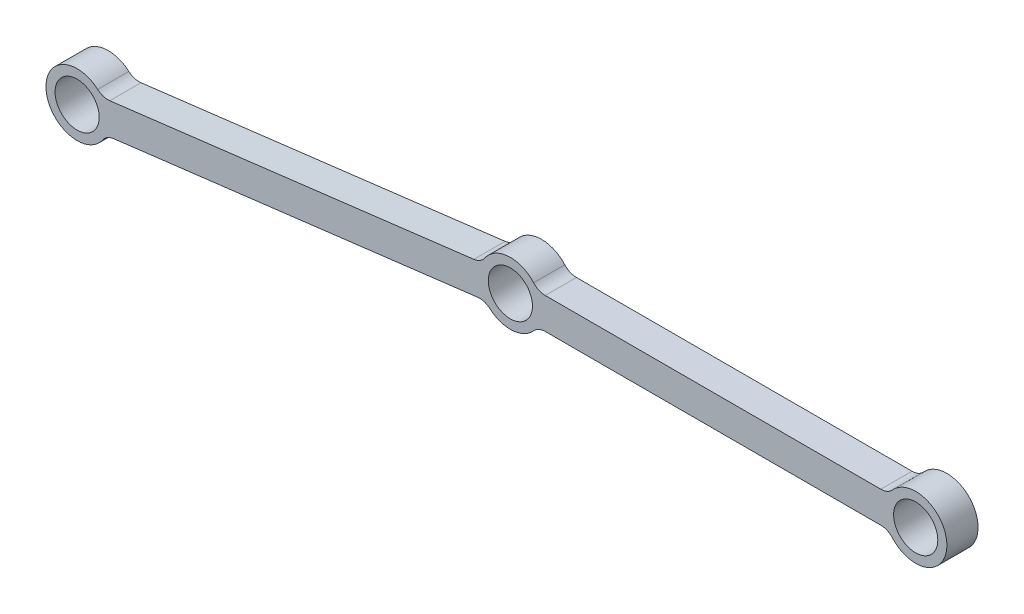
ISO-10303-21;
HEADER;
FILE_DESCRIPTION(('STEP AP214'),'2;1');
FILE_NAME('part.step','',(''),(''),'','','');
FILE_SCHEMA(('AUTOMOTIVE_DESIGN { 1 0 10303 214 1 1 1 1 }'));
ENDSEC;
DATA;
#1=APPLICATION_CONTEXT('core data for automotive mechanical design processes');
#2=APPLICATION_PROTOCOL_DEFINITION('international standard','automotive_design',2000,#1);
#3=PRODUCT_CONTEXT('',#1,'mechanical');
#4=PRODUCT('Part','Part','',(#3));
#5=PRODUCT_RELATED_PRODUCT_CATEGORY('part','',(#4));
#6=PRODUCT_DEFINITION_FORMATION('','',#4);
#7=PRODUCT_DEFINITION_CONTEXT('part definition',#1,'design');
#8=PRODUCT_DEFINITION('design','',#6,#7);
#9=PRODUCT_DEFINITION_SHAPE('','',#8);
#10=(LENGTH_UNIT() NAMED_UNIT(*) SI_UNIT(.MILLI.,.METRE.));
#11=(NAMED_UNIT(*) PLANE_ANGLE_UNIT() SI_UNIT($,.RADIAN.));
#12=(NAMED_UNIT(*) SI_UNIT($,.STERADIAN.) SOLID_ANGLE_UNIT());
#13=UNCERTAINTY_MEASURE_WITH_UNIT(LENGTH_MEASURE(1.E-05),#10,'distance_accuracy_value','');
#14=(GEOMETRIC_REPRESENTATION_CONTEXT(3) GLOBAL_UNCERTAINTY_ASSIGNED_CONTEXT((#13)) GLOBAL_UNIT_ASSIGNED_CONTEXT((#10,
#11,#12)) REPRESENTATION_CONTEXT('',''));
#15=CARTESIAN_POINT('',(0.,0.,0.));
#16=DIRECTION('',(0.,0.,1.));
#17=DIRECTION('',(1.,0.,0.));
#18=AXIS2_PLACEMENT_3D('',#15,#16,#17);
#19=CARTESIAN_POINT('',(-0.386935165311323,3.1513340314612,-6.35));
#20=DIRECTION('',(0.121869343405141,-0.992546151641323,0.));
#21=DIRECTION('',(0.992546151641323,0.121869343405141,0.));
#22=AXIS2_PLACEMENT_3D('',#19,#20,#21);
#23=PLANE('',#22);
#24=DIRECTION('',(0.992546151641323,0.121869343405141,0.));
#25=VECTOR('',#24,1.);
#26=CARTESIAN_POINT('',(-0.386935165311323,3.1513340314612,0.));
#27=LINE('',#26,#25);
#28=CARTESIAN_POINT('',(-81.5776909320692,-6.81763726473459,0.));
#29=VERTEX_POINT('',#28);
#30=CARTESIAN_POINT('',(-7.43353227946703,2.28612069893997,0.));
#31=VERTEX_POINT('',#30);
#32=EDGE_CURVE('E249',#29,#31,#27,.T.);
#33=ORIENTED_EDGE('',*,*,#32,.T.);
#34=DIRECTION('',(0.,0.,1.));
#35=VECTOR('',#34,1.);
#36=CARTESIAN_POINT('',(-7.43353227946703,2.28612069893997,-6.35));
#37=LINE('',#36,#35);
#38=CARTESIAN_POINT('',(-7.43353227946703,2.28612069893997,-6.35));
#39=VERTEX_POINT('',#38);
#40=EDGE_CURVE('E218',#31,#39,#37,.F.);
#41=ORIENTED_EDGE('',*,*,#40,.T.);
#42=DIRECTION('',(0.992546151641323,0.121869343405141,0.));
#43=VECTOR('',#42,1.);
#44=CARTESIAN_POINT('',(-0.386935165311323,3.1513340314612,-6.35));
#45=LINE('',#44,#43);
#46=CARTESIAN_POINT('',(-81.5776909320692,-6.81763726473459,-6.35));
#47=VERTEX_POINT('',#46);
#48=EDGE_CURVE('E261',#47,#39,#45,.T.);
#49=ORIENTED_EDGE('',*,*,#48,.F.);
#50=DIRECTION('',(0.,0.,1.));
#51=VECTOR('',#50,1.);
#52=CARTESIAN_POINT('',(-81.5776909320692,-6.81763726473459,-6.35));
#53=LINE('',#52,#51);
#54=EDGE_CURVE('E215',#47,#29,#53,.T.);
#55=ORIENTED_EDGE('',*,*,#54,.T.);
#56=EDGE_LOOP('',(#33,#41,#49,#55));
#57=FACE_BOUND('',#56,.T.);
#58=ADVANCED_FACE('F40',(#57),#23,.F.);
#59=CARTESIAN_POINT('',(0.,0.,-6.35));
#60=DIRECTION('',(0.,0.,1.));
#61=DIRECTION('',(1.,0.,0.));
#62=AXIS2_PLACEMENT_3D('',#59,#60,#61);
#63=CYLINDRICAL_SURFACE('',#62,6.35);
#64=CARTESIAN_POINT('',(0.,0.,-6.35));
#65=DIRECTION('',(0.,0.,1.));
#66=DIRECTION('',(1.,0.,0.));
#67=AXIS2_PLACEMENT_3D('',#64,#65,#66);
#68=CIRCLE('',#67,6.35);
#69=CARTESIAN_POINT('',(4.73301055237456,4.23333333333333,-6.35));
#70=VERTEX_POINT('',#69);
#71=CARTESIAN_POINT('',(-5.21364496318557,3.62496982026744,-6.35));
#72=VERTEX_POINT('',#71);
#73=EDGE_CURVE('E285',#70,#72,#68,.T.);
#74=ORIENTED_EDGE('',*,*,#73,.T.);
#75=DIRECTION('',(0.,0.,1.));
#76=VECTOR('',#75,1.);
#77=CARTESIAN_POINT('',(-5.21364496318557,3.62496982026744,-6.35));
#78=LINE('',#77,#76);
#79=CARTESIAN_POINT('',(-5.21364496318557,3.62496982026744,0.));
#80=VERTEX_POINT('',#79);
#81=EDGE_CURVE('E212',#72,#80,#78,.T.);
#82=ORIENTED_EDGE('',*,*,#81,.T.);
#83=CARTESIAN_POINT('',(0.,0.,0.));
#84=DIRECTION('',(0.,0.,1.));
#85=DIRECTION('',(1.,0.,0.));
#86=AXIS2_PLACEMENT_3D('',#83,#84,#85);
#87=CIRCLE('',#86,6.35);
#88=CARTESIAN_POINT('',(4.73301055237456,4.23333333333333,0.));
#89=VERTEX_POINT('',#88);
#90=EDGE_CURVE('E302',#89,#80,#87,.T.);
#91=ORIENTED_EDGE('',*,*,#90,.F.);
#92=DIRECTION('',(0.,0.,1.));
#93=VECTOR('',#92,1.);
#94=CARTESIAN_POINT('',(4.73301055237456,4.23333333333333,-6.35));
#95=LINE('',#94,#93);
#96=EDGE_CURVE('E210',#89,#70,#95,.F.);
#97=ORIENTED_EDGE('',*,*,#96,.T.);
#98=EDGE_LOOP('',(#74,#82,#91,#97));
#99=FACE_BOUND('',#98,.T.);
#100=ADVANCED_FACE('F332',(#99),#63,.T.);
#101=CARTESIAN_POINT('',(0.,3.175,-6.35));
#102=DIRECTION('',(0.,-1.,0.));
#103=DIRECTION('',(0.,0.,-1.));
#104=AXIS2_PLACEMENT_3D('',#101,#102,#103);
#105=PLANE('',#104);
#106=DIRECTION('',(1.,0.,0.));
#107=VECTOR('',#106,1.);
#108=CARTESIAN_POINT('',(0.,3.175,0.));
#109=LINE('',#108,#107);
#110=CARTESIAN_POINT('',(7.09951582856183,3.175,0.));
#111=VERTEX_POINT('',#110);
#112=CARTESIAN_POINT('',(75.4504841714381,3.175,0.));
#113=VERTEX_POINT('',#112);
#114=EDGE_CURVE('E177',#111,#113,#109,.T.);
#115=ORIENTED_EDGE('',*,*,#114,.T.);
#116=DIRECTION('',(0.,0.,1.));
#117=VECTOR('',#116,1.);
#118=CARTESIAN_POINT('',(75.4504841714381,3.175,-6.35));
#119=LINE('',#118,#117);
#120=CARTESIAN_POINT('',(75.4504841714381,3.175,-6.35));
#121=VERTEX_POINT('',#120);
#122=EDGE_CURVE('E194',#113,#121,#119,.F.);
#123=ORIENTED_EDGE('',*,*,#122,.T.);
#124=DIRECTION('',(1.,0.,0.));
#125=VECTOR('',#124,1.);
#126=CARTESIAN_POINT('',(0.,3.175,-6.35));
#127=LINE('',#126,#125);
#128=CARTESIAN_POINT('',(7.09951582856183,3.175,-6.35));
#129=VERTEX_POINT('',#128);
#130=EDGE_CURVE('E282',#129,#121,#127,.T.);
#131=ORIENTED_EDGE('',*,*,#130,.F.);
#132=DIRECTION('',(0.,0.,1.));
#133=VECTOR('',#132,1.);
#134=CARTESIAN_POINT('',(7.09951582856183,3.175,-6.35));
#135=LINE('',#134,#133);
#136=EDGE_CURVE('E183',#129,#111,#135,.T.);
#137=ORIENTED_EDGE('',*,*,#136,.T.);
#138=EDGE_LOOP('',(#115,#123,#131,#137));
#139=FACE_BOUND('',#138,.T.);
#140=ADVANCED_FACE('F337',(#139),#105,.F.);
#141=CARTESIAN_POINT('',(82.55,0.,-6.35));
#142=DIRECTION('',(0.,0.,1.));
#143=DIRECTION('',(1.,0.,0.));
#144=AXIS2_PLACEMENT_3D('',#141,#142,#143);
#145=CYLINDRICAL_SURFACE('',#144,6.35000000000001);
#146=CARTESIAN_POINT('',(82.55,0.,-6.35));
#147=DIRECTION('',(0.,0.,1.));
#148=DIRECTION('',(1.,0.,0.));
#149=AXIS2_PLACEMENT_3D('',#146,#147,#148);
#150=CIRCLE('',#149,6.35000000000001);
#151=CARTESIAN_POINT('',(77.8169894476254,-4.23333333333333,-6.35));
#152=VERTEX_POINT('',#151);
#153=CARTESIAN_POINT('',(77.8169894476254,4.23333333333333,-6.35));
#154=VERTEX_POINT('',#153);
#155=EDGE_CURVE('E280',#152,#154,#150,.T.);
#156=ORIENTED_EDGE('',*,*,#155,.T.);
#157=DIRECTION('',(0.,0.,1.));
#158=VECTOR('',#157,1.);
#159=CARTESIAN_POINT('',(77.8169894476254,4.23333333333333,-6.35));
#160=LINE('',#159,#158);
#161=CARTESIAN_POINT('',(77.8169894476254,4.23333333333333,0.));
#162=VERTEX_POINT('',#161);
#163=EDGE_CURVE('E176',#154,#162,#160,.T.);
#164=ORIENTED_EDGE('',*,*,#163,.T.);
#165=CARTESIAN_POINT('',(82.55,0.,0.));
#166=DIRECTION('',(0.,0.,1.));
#167=DIRECTION('',(1.,0.,0.));
#168=AXIS2_PLACEMENT_3D('',#165,#166,#167);
#169=CIRCLE('',#168,6.35000000000001);
#170=CARTESIAN_POINT('',(77.8169894476254,-4.23333333333333,0.));
#171=VERTEX_POINT('',#170);
#172=EDGE_CURVE('E159',#171,#162,#169,.T.);
#173=ORIENTED_EDGE('',*,*,#172,.F.);
#174=DIRECTION('',(0.,0.,1.));
#175=VECTOR('',#174,1.);
#176=CARTESIAN_POINT('',(77.8169894476254,-4.23333333333333,-6.35));
#177=LINE('',#176,#175);
#178=EDGE_CURVE('E173',#171,#152,#177,.F.);
#179=ORIENTED_EDGE('',*,*,#178,.T.);
#180=EDGE_LOOP('',(#156,#164,#173,#179));
#181=FACE_BOUND('',#180,.T.);
#182=ADVANCED_FACE('F172',(#181),#145,.T.);
#183=CARTESIAN_POINT('',(0.,-3.17500000000001,-6.35));
#184=DIRECTION('',(0.,-1.,0.));
#185=DIRECTION('',(1.,0.,0.));
#186=AXIS2_PLACEMENT_3D('',#183,#184,#185);
#187=PLANE('',#186);
#188=DIRECTION('',(1.,0.,0.));
#189=VECTOR('',#188,1.);
#190=CARTESIAN_POINT('',(0.,-3.17500000000001,-6.35));
#191=LINE('',#190,#189);
#192=CARTESIAN_POINT('',(7.09951582856183,-3.17500000000001,-6.35));
#193=VERTEX_POINT('',#192);
#194=CARTESIAN_POINT('',(75.4504841714381,-3.175,-6.35));
#195=VERTEX_POINT('',#194);
#196=EDGE_CURVE('E277',#193,#195,#191,.T.);
#197=ORIENTED_EDGE('',*,*,#196,.T.);
#198=DIRECTION('',(0.,0.,-1.));
#199=VECTOR('',#198,1.);
#200=CARTESIAN_POINT('',(75.4504841714381,-3.175,0.));
#201=LINE('',#200,#199);
#202=CARTESIAN_POINT('',(75.4504841714381,-3.175,0.));
#203=VERTEX_POINT('',#202);
#204=EDGE_CURVE('E198',#195,#203,#201,.F.);
#205=ORIENTED_EDGE('',*,*,#204,.T.);
#206=DIRECTION('',(1.,0.,0.));
#207=VECTOR('',#206,1.);
#208=CARTESIAN_POINT('',(0.,-3.17500000000001,0.));
#209=LINE('',#208,#207);
#210=CARTESIAN_POINT('',(7.09951582856183,-3.17500000000001,0.));
#211=VERTEX_POINT('',#210);
#212=EDGE_CURVE('E161',#211,#203,#209,.T.);
#213=ORIENTED_EDGE('',*,*,#212,.F.);
#214=DIRECTION('',(0.,0.,-1.));
#215=VECTOR('',#214,1.);
#216=CARTESIAN_POINT('',(7.09951582856183,-3.17500000000001,-6.35));
#217=LINE('',#216,#215);
#218=EDGE_CURVE('E196',#211,#193,#217,.T.);
#219=ORIENTED_EDGE('',*,*,#218,.T.);
#220=EDGE_LOOP('',(#197,#205,#213,#219));
#221=FACE_BOUND('',#220,.T.);
#222=ADVANCED_FACE('F383',(#221),#187,.T.);
#223=CARTESIAN_POINT('',(0.,0.,-6.35));
#224=DIRECTION('',(0.,0.,1.));
#225=DIRECTION('',(1.,0.,0.));
#226=AXIS2_PLACEMENT_3D('',#223,#224,#225);
#227=CYLINDRICAL_SURFACE('',#226,6.35);
#228=CARTESIAN_POINT('',(0.,0.,0.));
#229=DIRECTION('',(0.,0.,1.));
#230=DIRECTION('',(1.,0.,0.));
#231=AXIS2_PLACEMENT_3D('',#228,#229,#230);
#232=CIRCLE('',#231,6.35);
#233=CARTESIAN_POINT('',(-4.18181785568871,-4.77858759696242,0.));
#234=VERTEX_POINT('',#233);
#235=CARTESIAN_POINT('',(4.73301055237455,-4.23333333333334,0.));
#236=VERTEX_POINT('',#235);
#237=EDGE_CURVE('E296',#234,#236,#232,.T.);
#238=ORIENTED_EDGE('',*,*,#237,.F.);
#239=DIRECTION('',(0.,0.,1.));
#240=VECTOR('',#239,1.);
#241=CARTESIAN_POINT('',(-4.18181785568871,-4.77858759696242,-6.35));
#242=LINE('',#241,#240);
#243=CARTESIAN_POINT('',(-4.18181785568871,-4.77858759696242,-6.35));
#244=VERTEX_POINT('',#243);
#245=EDGE_CURVE('E208',#234,#244,#242,.F.);
#246=ORIENTED_EDGE('',*,*,#245,.T.);
#247=CARTESIAN_POINT('',(0.,0.,-6.35));
#248=DIRECTION('',(0.,0.,1.));
#249=DIRECTION('',(1.,0.,0.));
#250=AXIS2_PLACEMENT_3D('',#247,#248,#249);
#251=CIRCLE('',#250,6.35);
#252=CARTESIAN_POINT('',(4.73301055237455,-4.23333333333334,-6.35));
#253=VERTEX_POINT('',#252);
#254=EDGE_CURVE('E274',#244,#253,#251,.T.);
#255=ORIENTED_EDGE('',*,*,#254,.T.);
#256=DIRECTION('',(0.,0.,1.));
#257=VECTOR('',#256,1.);
#258=CARTESIAN_POINT('',(4.73301055237455,-4.23333333333334,-6.35));
#259=LINE('',#258,#257);
#260=EDGE_CURVE('E205',#253,#236,#259,.T.);
#261=ORIENTED_EDGE('',*,*,#260,.T.);
#262=EDGE_LOOP('',(#238,#246,#255,#261));
#263=FACE_BOUND('',#262,.T.);
#264=ADVANCED_FACE('F377',(#263),#227,.T.);
#265=CARTESIAN_POINT('',(0.386935165311322,-3.1513340314612,-6.35));
#266=DIRECTION('',(0.121869343405141,-0.992546151641323,0.));
#267=DIRECTION('',(0.992546151641323,0.121869343405141,0.));
#268=AXIS2_PLACEMENT_3D('',#265,#266,#267);
#269=PLANE('',#268);
#270=DIRECTION('',(0.992546151641323,0.121869343405141,0.));
#271=VECTOR('',#270,1.);
#272=CARTESIAN_POINT('',(0.386935165311322,-3.1513340314612,-6.35));
#273=LINE('',#272,#271);
#274=CARTESIAN_POINT('',(-80.8038206014466,-13.120305327657,-6.35));
#275=VERTEX_POINT('',#274);
#276=CARTESIAN_POINT('',(-6.65966194884438,-4.01654736398244,-6.35));
#277=VERTEX_POINT('',#276);
#278=EDGE_CURVE('E267',#275,#277,#273,.T.);
#279=ORIENTED_EDGE('',*,*,#278,.T.);
#280=DIRECTION('',(0.,0.,-1.));
#281=VECTOR('',#280,1.);
#282=CARTESIAN_POINT('',(-6.65966194884438,-4.01654736398244,0.));
#283=LINE('',#282,#281);
#284=CARTESIAN_POINT('',(-6.65966194884438,-4.01654736398244,0.));
#285=VERTEX_POINT('',#284);
#286=EDGE_CURVE('E202',#277,#285,#283,.F.);
#287=ORIENTED_EDGE('',*,*,#286,.T.);
#288=DIRECTION('',(0.992546151641323,0.121869343405141,0.));
#289=VECTOR('',#288,1.);
#290=CARTESIAN_POINT('',(0.386935165311322,-3.1513340314612,0.));
#291=LINE('',#290,#289);
#292=CARTESIAN_POINT('',(-80.8038206014466,-13.120305327657,0.));
#293=VERTEX_POINT('',#292);
#294=EDGE_CURVE('E254',#293,#285,#291,.T.);
#295=ORIENTED_EDGE('',*,*,#294,.F.);
#296=DIRECTION('',(0.,0.,-1.));
#297=VECTOR('',#296,1.);
#298=CARTESIAN_POINT('',(-80.8038206014465,-13.120305327657,-6.35));
#299=LINE('',#298,#297);
#300=EDGE_CURVE('E200',#293,#275,#299,.T.);
#301=ORIENTED_EDGE('',*,*,#300,.T.);
#302=EDGE_LOOP('',(#279,#287,#295,#301));
#303=FACE_BOUND('',#302,.T.);
#304=ADVANCED_FACE('F371',(#303),#269,.T.);
#305=CARTESIAN_POINT('',(0.,0.,-6.35));
#306=DIRECTION('',(0.,0.,1.));
#307=DIRECTION('',(1.,0.,0.));
#308=AXIS2_PLACEMENT_3D('',#305,#306,#307);
#309=CYLINDRICAL_SURFACE('',#308,4.49961);
#310=CARTESIAN_POINT('',(0.,0.,-6.35));
#311=DIRECTION('',(0.,0.,1.));
#312=DIRECTION('',(1.,0.,0.));
#313=AXIS2_PLACEMENT_3D('',#310,#311,#312);
#314=CIRCLE('',#313,4.49961);
#315=CARTESIAN_POINT('',(4.49961,0.,-6.35));
#316=VERTEX_POINT('',#315);
#317=EDGE_CURVE('E186',#316,#316,#314,.T.);
#318=ORIENTED_EDGE('',*,*,#317,.F.);
#319=EDGE_LOOP('',(#318));
#320=FACE_BOUND('',#319,.T.);
#321=CARTESIAN_POINT('',(0.,0.,0.));
#322=DIRECTION('',(0.,0.,1.));
#323=DIRECTION('',(1.,0.,0.));
#324=AXIS2_PLACEMENT_3D('',#321,#322,#323);
#325=CIRCLE('',#324,4.49961);
#326=CARTESIAN_POINT('',(4.49961,0.,0.));
#327=VERTEX_POINT('',#326);
#328=EDGE_CURVE('E270',#327,#327,#325,.T.);
#329=ORIENTED_EDGE('',*,*,#328,.T.);
#330=EDGE_LOOP('',(#329));
#331=FACE_BOUND('',#330,.T.);
#332=ADVANCED_FACE('F310',(#320,#331),#309,.F.);
#333=CARTESIAN_POINT('',(82.55,0.,-6.35));
#334=DIRECTION('',(0.,0.,1.));
#335=DIRECTION('',(1.,0.,0.));
#336=AXIS2_PLACEMENT_3D('',#333,#334,#335);
#337=CYLINDRICAL_SURFACE('',#336,4.49961);
#338=CARTESIAN_POINT('',(82.55,0.,-6.35));
#339=DIRECTION('',(0.,0.,1.));
#340=DIRECTION('',(1.,0.,0.));
#341=AXIS2_PLACEMENT_3D('',#338,#339,#340);
#342=CIRCLE('',#341,4.49961);
#343=CARTESIAN_POINT('',(87.04961,0.,-6.35));
#344=VERTEX_POINT('',#343);
#345=EDGE_CURVE('E288',#344,#344,#342,.T.);
#346=ORIENTED_EDGE('',*,*,#345,.F.);
#347=EDGE_LOOP('',(#346));
#348=FACE_BOUND('',#347,.T.);
#349=CARTESIAN_POINT('',(82.55,0.,0.));
#350=DIRECTION('',(0.,0.,1.));
#351=DIRECTION('',(1.,0.,0.));
#352=AXIS2_PLACEMENT_3D('',#349,#350,#351);
#353=CIRCLE('',#352,4.49961);
#354=CARTESIAN_POINT('',(87.04961,0.,0.));
#355=VERTEX_POINT('',#354);
#356=EDGE_CURVE('E305',#355,#355,#353,.T.);
#357=ORIENTED_EDGE('',*,*,#356,.T.);
#358=EDGE_LOOP('',(#357));
#359=FACE_BOUND('',#358,.T.);
#360=ADVANCED_FACE('F327',(#348,#359),#337,.F.);
#361=CARTESIAN_POINT('',(-88.2373528809136,-10.834184628717,-6.35));
#362=DIRECTION('',(0.,0.,1.));
#363=DIRECTION('',(1.,0.,0.));
#364=AXIS2_PLACEMENT_3D('',#361,#362,#363);
#365=CYLINDRICAL_SURFACE('',#364,6.35000000000001);
#366=CARTESIAN_POINT('',(-88.2373528809136,-10.834184628717,-6.35));
#367=DIRECTION('',(0.,0.,1.));
#368=DIRECTION('',(1.,0.,0.));
#369=AXIS2_PLACEMENT_3D('',#366,#367,#368);
#370=CIRCLE('',#369,6.35000000000001);
#371=CARTESIAN_POINT('',(-84.0555350252249,-6.0555970317546,-6.35));
#372=VERTEX_POINT('',#371);
#373=CARTESIAN_POINT('',(-83.023707917728,-14.4591544489845,-6.35));
#374=VERTEX_POINT('',#373);
#375=EDGE_CURVE('E263',#372,#374,#370,.T.);
#376=ORIENTED_EDGE('',*,*,#375,.T.);
#377=DIRECTION('',(0.,0.,1.));
#378=VECTOR('',#377,1.);
#379=CARTESIAN_POINT('',(-83.023707917728,-14.4591544489845,-6.35));
#380=LINE('',#379,#378);
#381=CARTESIAN_POINT('',(-83.023707917728,-14.4591544489845,0.));
#382=VERTEX_POINT('',#381);
#383=EDGE_CURVE('E221',#374,#382,#380,.T.);
#384=ORIENTED_EDGE('',*,*,#383,.T.);
#385=CARTESIAN_POINT('',(-88.2373528809136,-10.834184628717,0.));
#386=DIRECTION('',(0.,0.,1.));
#387=DIRECTION('',(1.,0.,0.));
#388=AXIS2_PLACEMENT_3D('',#385,#386,#387);
#389=CIRCLE('',#388,6.35000000000001);
#390=CARTESIAN_POINT('',(-84.0555350252249,-6.0555970317546,0.));
#391=VERTEX_POINT('',#390);
#392=EDGE_CURVE('E247',#391,#382,#389,.T.);
#393=ORIENTED_EDGE('',*,*,#392,.F.);
#394=DIRECTION('',(0.,0.,1.));
#395=VECTOR('',#394,1.);
#396=CARTESIAN_POINT('',(-84.0555350252249,-6.0555970317546,-6.35));
#397=LINE('',#396,#395);
#398=EDGE_CURVE('E62',#391,#372,#397,.F.);
#399=ORIENTED_EDGE('',*,*,#398,.T.);
#400=EDGE_LOOP('',(#376,#384,#393,#399));
#401=FACE_BOUND('',#400,.T.);
#402=ADVANCED_FACE('F252',(#401),#365,.T.);
#403=CARTESIAN_POINT('',(-88.2373528809136,-10.834184628717,-6.35));
#404=DIRECTION('',(0.,0.,1.));
#405=DIRECTION('',(1.,0.,0.));
#406=AXIS2_PLACEMENT_3D('',#403,#404,#405);
#407=CYLINDRICAL_SURFACE('',#406,4.49961);
#408=CARTESIAN_POINT('',(-88.2373528809136,-10.834184628717,-6.35));
#409=DIRECTION('',(0.,0.,1.));
#410=DIRECTION('',(1.,0.,0.));
#411=AXIS2_PLACEMENT_3D('',#408,#409,#410);
#412=CIRCLE('',#411,4.49961);
#413=CARTESIAN_POINT('',(-83.7377428809136,-10.834184628717,-6.35));
#414=VERTEX_POINT('',#413);
#415=EDGE_CURVE('E181',#414,#414,#412,.T.);
#416=ORIENTED_EDGE('',*,*,#415,.F.);
#417=EDGE_LOOP('',(#416));
#418=FACE_BOUND('',#417,.T.);
#419=CARTESIAN_POINT('',(-88.2373528809136,-10.834184628717,0.));
#420=DIRECTION('',(0.,0.,1.));
#421=DIRECTION('',(1.,0.,0.));
#422=AXIS2_PLACEMENT_3D('',#419,#420,#421);
#423=CIRCLE('',#422,4.49961);
#424=CARTESIAN_POINT('',(-83.7377428809136,-10.834184628717,0.));
#425=VERTEX_POINT('',#424);
#426=EDGE_CURVE('E189',#425,#425,#423,.T.);
#427=ORIENTED_EDGE('',*,*,#426,.T.);
#428=EDGE_LOOP('',(#427));
#429=FACE_BOUND('',#428,.T.);
#430=ADVANCED_FACE('F318',(#418,#429),#407,.F.);
#431=CARTESIAN_POINT('',(0.,0.,-6.35));
#432=DIRECTION('',(0.,0.,1.));
#433=DIRECTION('',(1.,0.,0.));
#434=AXIS2_PLACEMENT_3D('',#431,#432,#433);
#435=PLANE('',#434);
#436=ORIENTED_EDGE('',*,*,#375,.F.);
#437=CARTESIAN_POINT('',(-81.9646260973805,-3.66630323327339,-6.35));
#438=DIRECTION('',(0.,0.,1.));
#439=DIRECTION('',(1.,0.,0.));
#440=AXIS2_PLACEMENT_3D('',#437,#438,#439);
#441=CIRCLE('',#440,3.175);
#442=EDGE_CURVE('E11',#372,#47,#441,.T.);
#443=ORIENTED_EDGE('',*,*,#442,.T.);
#444=ORIENTED_EDGE('',*,*,#48,.T.);
#445=CARTESIAN_POINT('',(-7.82046744477835,5.43745473040116,-6.35));
#446=DIRECTION('',(0.,0.,1.));
#447=DIRECTION('',(1.,0.,0.));
#448=AXIS2_PLACEMENT_3D('',#445,#446,#447);
#449=CIRCLE('',#448,3.175);
#450=EDGE_CURVE('E234',#39,#72,#449,.T.);
#451=ORIENTED_EDGE('',*,*,#450,.T.);
#452=ORIENTED_EDGE('',*,*,#73,.F.);
#453=CARTESIAN_POINT('',(7.09951582856183,6.35,-6.35));
#454=DIRECTION('',(0.,0.,1.));
#455=DIRECTION('',(1.,0.,0.));
#456=AXIS2_PLACEMENT_3D('',#453,#454,#455);
#457=CIRCLE('',#456,3.175);
#458=EDGE_CURVE('E238',#70,#129,#457,.T.);
#459=ORIENTED_EDGE('',*,*,#458,.T.);
#460=ORIENTED_EDGE('',*,*,#130,.T.);
#461=CARTESIAN_POINT('',(75.4504841714381,6.35,-6.35));
#462=DIRECTION('',(0.,0.,1.));
#463=DIRECTION('',(1.,0.,0.));
#464=AXIS2_PLACEMENT_3D('',#461,#462,#463);
#465=CIRCLE('',#464,3.175);
#466=EDGE_CURVE('E167',#121,#154,#465,.T.);
#467=ORIENTED_EDGE('',*,*,#466,.T.);
#468=ORIENTED_EDGE('',*,*,#155,.F.);
#469=CARTESIAN_POINT('',(75.4504841714381,-6.35,-6.35));
#470=DIRECTION('',(0.,0.,1.));
#471=DIRECTION('',(1.,0.,0.));
#472=AXIS2_PLACEMENT_3D('',#469,#470,#471);
#473=CIRCLE('',#472,3.175);
#474=EDGE_CURVE('E166',#152,#195,#473,.T.);
#475=ORIENTED_EDGE('',*,*,#474,.T.);
#476=ORIENTED_EDGE('',*,*,#196,.F.);
#477=CARTESIAN_POINT('',(7.09951582856183,-6.35000000000001,-6.35));
#478=DIRECTION('',(0.,0.,1.));
#479=DIRECTION('',(1.,0.,0.));
#480=AXIS2_PLACEMENT_3D('',#477,#478,#479);
#481=CIRCLE('',#480,3.175);
#482=EDGE_CURVE('E242',#193,#253,#481,.T.);
#483=ORIENTED_EDGE('',*,*,#482,.T.);
#484=ORIENTED_EDGE('',*,*,#254,.F.);
#485=CARTESIAN_POINT('',(-6.27272678353306,-7.16788139544364,-6.35));
#486=DIRECTION('',(0.,0.,1.));
#487=DIRECTION('',(1.,0.,0.));
#488=AXIS2_PLACEMENT_3D('',#485,#486,#487);
#489=CIRCLE('',#488,3.175);
#490=EDGE_CURVE('E230',#244,#277,#489,.T.);
#491=ORIENTED_EDGE('',*,*,#490,.T.);
#492=ORIENTED_EDGE('',*,*,#278,.F.);
#493=CARTESIAN_POINT('',(-80.4168854361352,-16.2716393591182,-6.35));
#494=DIRECTION('',(0.,0.,1.));
#495=DIRECTION('',(1.,0.,0.));
#496=AXIS2_PLACEMENT_3D('',#493,#494,#495);
#497=CIRCLE('',#496,3.175);
#498=EDGE_CURVE('E55',#275,#374,#497,.T.);
#499=ORIENTED_EDGE('',*,*,#498,.T.);
#500=EDGE_LOOP('',(#436,#443,#444,#451,#452,#459,#460,#467,#468,#475,#476,#483,#484,#491,#492,#499));
#501=FACE_BOUND('',#500,.T.);
#502=ORIENTED_EDGE('',*,*,#345,.T.);
#503=EDGE_LOOP('',(#502));
#504=FACE_BOUND('',#503,.T.);
#505=ORIENTED_EDGE('',*,*,#317,.T.);
#506=EDGE_LOOP('',(#505));
#507=FACE_BOUND('',#506,.T.);
#508=ORIENTED_EDGE('',*,*,#415,.T.);
#509=EDGE_LOOP('',(#508));
#510=FACE_BOUND('',#509,.T.);
#511=ADVANCED_FACE('F259',(#501,#504,#507,#510),#435,.F.);
#512=CARTESIAN_POINT('',(0.,0.,0.));
#513=DIRECTION('',(0.,0.,1.));
#514=DIRECTION('',(1.,0.,0.));
#515=AXIS2_PLACEMENT_3D('',#512,#513,#514);
#516=PLANE('',#515);
#517=ORIENTED_EDGE('',*,*,#32,.F.);
#518=CARTESIAN_POINT('',(-81.9646260973805,-3.66630323327339,0.));
#519=DIRECTION('',(0.,0.,1.));
#520=DIRECTION('',(1.,0.,0.));
#521=AXIS2_PLACEMENT_3D('',#518,#519,#520);
#522=CIRCLE('',#521,3.175);
#523=EDGE_CURVE('E48',#29,#391,#522,.F.);
#524=ORIENTED_EDGE('',*,*,#523,.T.);
#525=ORIENTED_EDGE('',*,*,#392,.T.);
#526=CARTESIAN_POINT('',(-80.4168854361352,-16.2716393591182,0.));
#527=DIRECTION('',(0.,0.,1.));
#528=DIRECTION('',(1.,0.,0.));
#529=AXIS2_PLACEMENT_3D('',#526,#527,#528);
#530=CIRCLE('',#529,3.175);
#531=EDGE_CURVE('E244',#382,#293,#530,.F.);
#532=ORIENTED_EDGE('',*,*,#531,.T.);
#533=ORIENTED_EDGE('',*,*,#294,.T.);
#534=CARTESIAN_POINT('',(-6.27272678353306,-7.16788139544364,0.));
#535=DIRECTION('',(0.,0.,1.));
#536=DIRECTION('',(1.,0.,0.));
#537=AXIS2_PLACEMENT_3D('',#534,#535,#536);
#538=CIRCLE('',#537,3.175);
#539=EDGE_CURVE('E228',#285,#234,#538,.F.);
#540=ORIENTED_EDGE('',*,*,#539,.T.);
#541=ORIENTED_EDGE('',*,*,#237,.T.);
#542=CARTESIAN_POINT('',(7.09951582856183,-6.35000000000001,0.));
#543=DIRECTION('',(0.,0.,1.));
#544=DIRECTION('',(1.,0.,0.));
#545=AXIS2_PLACEMENT_3D('',#542,#543,#544);
#546=CIRCLE('',#545,3.175);
#547=EDGE_CURVE('E240',#236,#211,#546,.F.);
#548=ORIENTED_EDGE('',*,*,#547,.T.);
#549=ORIENTED_EDGE('',*,*,#212,.T.);
#550=CARTESIAN_POINT('',(75.4504841714381,-6.35,0.));
#551=DIRECTION('',(0.,0.,1.));
#552=DIRECTION('',(1.,0.,0.));
#553=AXIS2_PLACEMENT_3D('',#550,#551,#552);
#554=CIRCLE('',#553,3.175);
#555=EDGE_CURVE('E154',#203,#171,#554,.F.);
#556=ORIENTED_EDGE('',*,*,#555,.T.);
#557=ORIENTED_EDGE('',*,*,#172,.T.);
#558=CARTESIAN_POINT('',(75.4504841714381,6.35,0.));
#559=DIRECTION('',(0.,0.,1.));
#560=DIRECTION('',(1.,0.,0.));
#561=AXIS2_PLACEMENT_3D('',#558,#559,#560);
#562=CIRCLE('',#561,3.175);
#563=EDGE_CURVE('E224',#162,#113,#562,.F.);
#564=ORIENTED_EDGE('',*,*,#563,.T.);
#565=ORIENTED_EDGE('',*,*,#114,.F.);
#566=CARTESIAN_POINT('',(7.09951582856183,6.35,0.));
#567=DIRECTION('',(0.,0.,1.));
#568=DIRECTION('',(1.,0.,0.));
#569=AXIS2_PLACEMENT_3D('',#566,#567,#568);
#570=CIRCLE('',#569,3.175);
#571=EDGE_CURVE('E236',#111,#89,#570,.F.);
#572=ORIENTED_EDGE('',*,*,#571,.T.);
#573=ORIENTED_EDGE('',*,*,#90,.T.);
#574=CARTESIAN_POINT('',(-7.82046744477835,5.43745473040116,0.));
#575=DIRECTION('',(0.,0.,1.));
#576=DIRECTION('',(1.,0.,0.));
#577=AXIS2_PLACEMENT_3D('',#574,#575,#576);
#578=CIRCLE('',#577,3.175);
#579=EDGE_CURVE('E232',#80,#31,#578,.F.);
#580=ORIENTED_EDGE('',*,*,#579,.T.);
#581=EDGE_LOOP('',(#517,#524,#525,#532,#533,#540,#541,#548,#549,#556,#557,#564,#565,#572,#573,#580));
#582=FACE_BOUND('',#581,.T.);
#583=ORIENTED_EDGE('',*,*,#356,.F.);
#584=EDGE_LOOP('',(#583));
#585=FACE_BOUND('',#584,.T.);
#586=ORIENTED_EDGE('',*,*,#328,.F.);
#587=EDGE_LOOP('',(#586));
#588=FACE_BOUND('',#587,.T.);
#589=ORIENTED_EDGE('',*,*,#426,.F.);
#590=EDGE_LOOP('',(#589));
#591=FACE_BOUND('',#590,.T.);
#592=ADVANCED_FACE('F157',(#582,#585,#588,#591),#516,.T.);
#593=CARTESIAN_POINT('',(75.4504841714381,6.35,-6.35));
#594=DIRECTION('',(0.,0.,1.));
#595=DIRECTION('',(1.,0.,0.));
#596=AXIS2_PLACEMENT_3D('',#593,#594,#595);
#597=CYLINDRICAL_SURFACE('',#596,3.175);
#598=ORIENTED_EDGE('',*,*,#466,.F.);
#599=ORIENTED_EDGE('',*,*,#122,.F.);
#600=ORIENTED_EDGE('',*,*,#563,.F.);
#601=ORIENTED_EDGE('',*,*,#163,.F.);
#602=EDGE_LOOP('',(#598,#599,#600,#601));
#603=FACE_BOUND('',#602,.T.);
#604=ADVANCED_FACE('F314',(#603),#597,.F.);
#605=CARTESIAN_POINT('',(75.4504841714381,-6.35,-6.35));
#606=DIRECTION('',(0.,0.,1.));
#607=DIRECTION('',(1.,0.,0.));
#608=AXIS2_PLACEMENT_3D('',#605,#606,#607);
#609=CYLINDRICAL_SURFACE('',#608,3.175);
#610=ORIENTED_EDGE('',*,*,#474,.F.);
#611=ORIENTED_EDGE('',*,*,#178,.F.);
#612=ORIENTED_EDGE('',*,*,#555,.F.);
#613=ORIENTED_EDGE('',*,*,#204,.F.);
#614=EDGE_LOOP('',(#610,#611,#612,#613));
#615=FACE_BOUND('',#614,.T.);
#616=ADVANCED_FACE('F180',(#615),#609,.F.);
#617=CARTESIAN_POINT('',(-6.27272678353306,-7.16788139544364,-6.35));
#618=DIRECTION('',(0.,0.,1.));
#619=DIRECTION('',(1.,0.,0.));
#620=AXIS2_PLACEMENT_3D('',#617,#618,#619);
#621=CYLINDRICAL_SURFACE('',#620,3.175);
#622=ORIENTED_EDGE('',*,*,#490,.F.);
#623=ORIENTED_EDGE('',*,*,#245,.F.);
#624=ORIENTED_EDGE('',*,*,#539,.F.);
#625=ORIENTED_EDGE('',*,*,#286,.F.);
#626=EDGE_LOOP('',(#622,#623,#624,#625));
#627=FACE_BOUND('',#626,.T.);
#628=ADVANCED_FACE('F347',(#627),#621,.F.);
#629=CARTESIAN_POINT('',(-7.82046744477835,5.43745473040116,-6.35));
#630=DIRECTION('',(0.,0.,1.));
#631=DIRECTION('',(1.,0.,0.));
#632=AXIS2_PLACEMENT_3D('',#629,#630,#631);
#633=CYLINDRICAL_SURFACE('',#632,3.175);
#634=ORIENTED_EDGE('',*,*,#450,.F.);
#635=ORIENTED_EDGE('',*,*,#40,.F.);
#636=ORIENTED_EDGE('',*,*,#579,.F.);
#637=ORIENTED_EDGE('',*,*,#81,.F.);
#638=EDGE_LOOP('',(#634,#635,#636,#637));
#639=FACE_BOUND('',#638,.T.);
#640=ADVANCED_FACE('F350',(#639),#633,.F.);
#641=CARTESIAN_POINT('',(7.09951582856183,6.35,-6.35));
#642=DIRECTION('',(0.,0.,1.));
#643=DIRECTION('',(1.,0.,0.));
#644=AXIS2_PLACEMENT_3D('',#641,#642,#643);
#645=CYLINDRICAL_SURFACE('',#644,3.175);
#646=ORIENTED_EDGE('',*,*,#458,.F.);
#647=ORIENTED_EDGE('',*,*,#96,.F.);
#648=ORIENTED_EDGE('',*,*,#571,.F.);
#649=ORIENTED_EDGE('',*,*,#136,.F.);
#650=EDGE_LOOP('',(#646,#647,#648,#649));
#651=FACE_BOUND('',#650,.T.);
#652=ADVANCED_FACE('F354',(#651),#645,.F.);
#653=CARTESIAN_POINT('',(7.09951582856183,-6.35000000000001,-6.35));
#654=DIRECTION('',(0.,0.,1.));
#655=DIRECTION('',(1.,0.,0.));
#656=AXIS2_PLACEMENT_3D('',#653,#654,#655);
#657=CYLINDRICAL_SURFACE('',#656,3.175);
#658=ORIENTED_EDGE('',*,*,#482,.F.);
#659=ORIENTED_EDGE('',*,*,#218,.F.);
#660=ORIENTED_EDGE('',*,*,#547,.F.);
#661=ORIENTED_EDGE('',*,*,#260,.F.);
#662=EDGE_LOOP('',(#658,#659,#660,#661));
#663=FACE_BOUND('',#662,.T.);
#664=ADVANCED_FACE('F358',(#663),#657,.F.);
#665=CARTESIAN_POINT('',(-80.4168854361352,-16.2716393591182,-6.35));
#666=DIRECTION('',(0.,0.,1.));
#667=DIRECTION('',(1.,0.,0.));
#668=AXIS2_PLACEMENT_3D('',#665,#666,#667);
#669=CYLINDRICAL_SURFACE('',#668,3.175);
#670=ORIENTED_EDGE('',*,*,#498,.F.);
#671=ORIENTED_EDGE('',*,*,#300,.F.);
#672=ORIENTED_EDGE('',*,*,#531,.F.);
#673=ORIENTED_EDGE('',*,*,#383,.F.);
#674=EDGE_LOOP('',(#670,#671,#672,#673));
#675=FACE_BOUND('',#674,.T.);
#676=ADVANCED_FACE('F361',(#675),#669,.F.);
#677=CARTESIAN_POINT('',(-81.9646260973805,-3.66630323327339,-6.35));
#678=DIRECTION('',(0.,0.,1.));
#679=DIRECTION('',(1.,0.,0.));
#680=AXIS2_PLACEMENT_3D('',#677,#678,#679);
#681=CYLINDRICAL_SURFACE('',#680,3.175);
#682=ORIENTED_EDGE('',*,*,#442,.F.);
#683=ORIENTED_EDGE('',*,*,#398,.F.);
#684=ORIENTED_EDGE('',*,*,#523,.F.);
#685=ORIENTED_EDGE('',*,*,#54,.F.);
#686=EDGE_LOOP('',(#682,#683,#684,#685));
#687=FACE_BOUND('',#686,.T.);
#688=ADVANCED_FACE('F42',(#687),#681,.F.);
#689=CLOSED_SHELL('',(#58,#100,#140,#182,#222,#264,#304,#332,#360,#402,#430,#511,#592,#604,#616,
#628,#640,#652,#664,#676,#688));
#690=MANIFOLD_SOLID_BREP('B2',#689);
#691=ADVANCED_BREP_SHAPE_REPRESENTATION('',(#18,#690),#14);
#692=SHAPE_DEFINITION_REPRESENTATION(#9,#691);
ENDSEC;
END-ISO-10303-21;
